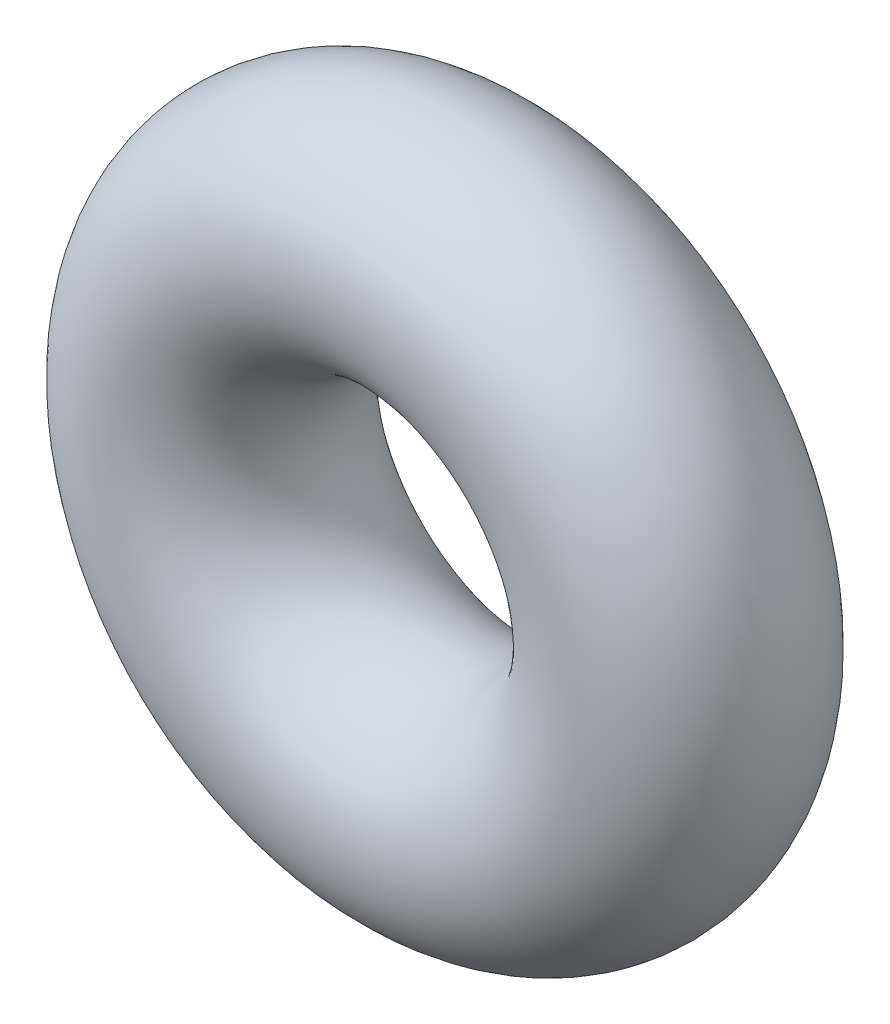
ISO-10303-21;
HEADER;
FILE_DESCRIPTION(('STEP AP214'),'2;1');
FILE_NAME('part.step','',(''),(''),'','','');
FILE_SCHEMA(('AUTOMOTIVE_DESIGN { 1 0 10303 214 1 1 1 1 }'));
ENDSEC;
DATA;
#1=APPLICATION_CONTEXT('core data for automotive mechanical design processes');
#2=APPLICATION_PROTOCOL_DEFINITION('international standard','automotive_design',2000,#1);
#3=PRODUCT_CONTEXT('',#1,'mechanical');
#4=PRODUCT('Part','Part','',(#3));
#5=PRODUCT_RELATED_PRODUCT_CATEGORY('part','',(#4));
#6=PRODUCT_DEFINITION_FORMATION('','',#4);
#7=PRODUCT_DEFINITION_CONTEXT('part definition',#1,'design');
#8=PRODUCT_DEFINITION('design','',#6,#7);
#9=PRODUCT_DEFINITION_SHAPE('','',#8);
#10=(LENGTH_UNIT() NAMED_UNIT(*) SI_UNIT(.MILLI.,.METRE.));
#11=(NAMED_UNIT(*) PLANE_ANGLE_UNIT() SI_UNIT($,.RADIAN.));
#12=(NAMED_UNIT(*) SI_UNIT($,.STERADIAN.) SOLID_ANGLE_UNIT());
#13=UNCERTAINTY_MEASURE_WITH_UNIT(LENGTH_MEASURE(1.E-05),#10,'distance_accuracy_value','');
#14=(GEOMETRIC_REPRESENTATION_CONTEXT(3) GLOBAL_UNCERTAINTY_ASSIGNED_CONTEXT((#13)) GLOBAL_UNIT_ASSIGNED_CONTEXT((#10,
#11,#12)) REPRESENTATION_CONTEXT('',''));
#15=CARTESIAN_POINT('',(0.,0.,0.));
#16=DIRECTION('',(0.,0.,1.));
#17=DIRECTION('',(1.,0.,0.));
#18=AXIS2_PLACEMENT_3D('',#15,#16,#17);
#19=CARTESIAN_POINT('',(0.,0.,0.));
#20=DIRECTION('',(0.,0.,1.));
#21=DIRECTION('',(1.,0.,0.));
#22=AXIS2_PLACEMENT_3D('',#19,#20,#21);
#23=TOROIDAL_SURFACE('',#22,1.778,0.889);
#24=CARTESIAN_POINT('',(2.667,0.,0.));
#25=VERTEX_POINT('',#24);
#26=VERTEX_LOOP('',#25);
#27=FACE_BOUND('',#26,.T.);
#28=ADVANCED_FACE('F30',(#27),#23,.T.);
#29=CLOSED_SHELL('',(#28));
#30=MANIFOLD_SOLID_BREP('B2',#29);
#31=ADVANCED_BREP_SHAPE_REPRESENTATION('',(#18,#30),#14);
#32=SHAPE_DEFINITION_REPRESENTATION(#9,#31);
ENDSEC;
END-ISO-10303-21;
